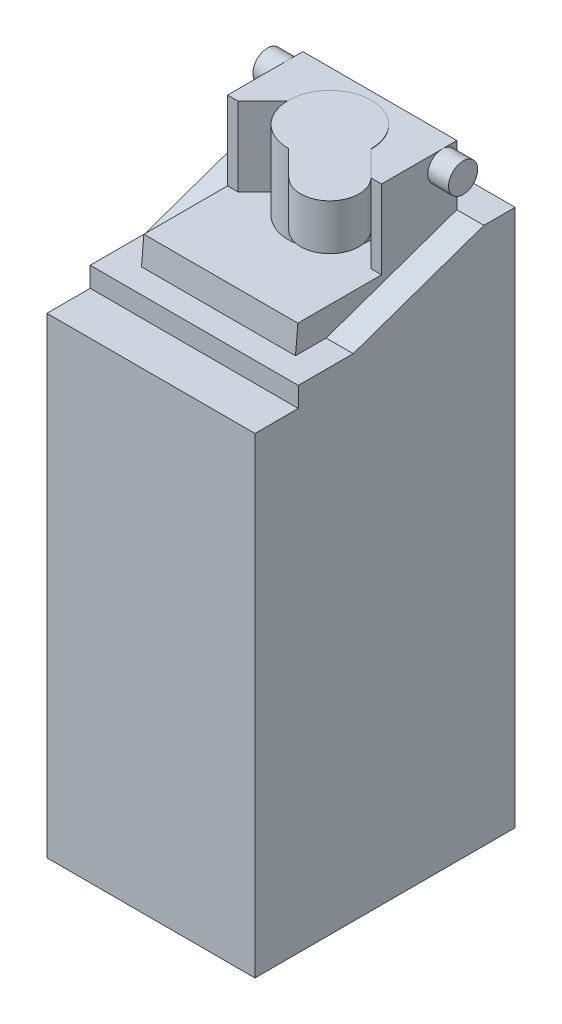
ISO-10303-21;
HEADER;
FILE_DESCRIPTION(('STEP AP214'),'2;1');
FILE_NAME('part.step','',(''),(''),'','','');
FILE_SCHEMA(('AUTOMOTIVE_DESIGN { 1 0 10303 214 1 1 1 1 }'));
ENDSEC;
DATA;
#1=APPLICATION_CONTEXT('core data for automotive mechanical design processes');
#2=APPLICATION_PROTOCOL_DEFINITION('international standard','automotive_design',2000,#1);
#3=PRODUCT_CONTEXT('',#1,'mechanical');
#4=PRODUCT('Part','Part','',(#3));
#5=PRODUCT_RELATED_PRODUCT_CATEGORY('part','',(#4));
#6=PRODUCT_DEFINITION_FORMATION('','',#4);
#7=PRODUCT_DEFINITION_CONTEXT('part definition',#1,'design');
#8=PRODUCT_DEFINITION('design','',#6,#7);
#9=PRODUCT_DEFINITION_SHAPE('','',#8);
#10=(LENGTH_UNIT() NAMED_UNIT(*) SI_UNIT(.MILLI.,.METRE.));
#11=(NAMED_UNIT(*) PLANE_ANGLE_UNIT() SI_UNIT($,.RADIAN.));
#12=(NAMED_UNIT(*) SI_UNIT($,.STERADIAN.) SOLID_ANGLE_UNIT());
#13=UNCERTAINTY_MEASURE_WITH_UNIT(LENGTH_MEASURE(1.E-05),#10,'distance_accuracy_value','');
#14=(GEOMETRIC_REPRESENTATION_CONTEXT(3) GLOBAL_UNCERTAINTY_ASSIGNED_CONTEXT((#13)) GLOBAL_UNIT_ASSIGNED_CONTEXT((#10,
#11,#12)) REPRESENTATION_CONTEXT('',''));
#15=CARTESIAN_POINT('',(0.,0.,0.));
#16=DIRECTION('',(0.,0.,1.));
#17=DIRECTION('',(1.,0.,0.));
#18=AXIS2_PLACEMENT_3D('',#15,#16,#17);
#19=CARTESIAN_POINT('',(3.7,28.7,-7.38));
#20=DIRECTION('',(0.,-1.,0.));
#21=DIRECTION('',(0.,0.,-1.));
#22=AXIS2_PLACEMENT_3D('',#19,#20,#21);
#23=PLANE('',#22);
#24=CARTESIAN_POINT('',(0.,28.7,-8.6));
#25=DIRECTION('',(0.,-1.,0.));
#26=DIRECTION('',(0.,0.,-1.));
#27=AXIS2_PLACEMENT_3D('',#24,#25,#26);
#28=CIRCLE('',#27,2.);
#29=CARTESIAN_POINT('',(1.99990098524558,28.7,-8.58009901475445));
#30=VERTEX_POINT('',#29);
#31=CARTESIAN_POINT('',(-1.99990098524558,28.7,-8.5800990147544));
#32=VERTEX_POINT('',#31);
#33=EDGE_CURVE('E40',#30,#32,#28,.F.);
#34=ORIENTED_EDGE('',*,*,#33,.F.);
#35=DIRECTION('',(-0.707106781186551,0.,-0.707106781186544));
#36=VECTOR('',#35,1.);
#37=CARTESIAN_POINT('',(0.,28.7,-10.58));
#38=LINE('',#37,#36);
#39=CARTESIAN_POINT('',(3.20000000000005,28.7,-7.38));
#40=VERTEX_POINT('',#39);
#41=EDGE_CURVE('E227',#40,#30,#38,.T.);
#42=ORIENTED_EDGE('',*,*,#41,.F.);
#43=DIRECTION('',(-1.,0.,0.));
#44=VECTOR('',#43,1.);
#45=CARTESIAN_POINT('',(3.7,28.7,-7.38));
#46=LINE('',#45,#44);
#47=CARTESIAN_POINT('',(3.7,28.7,-7.38));
#48=VERTEX_POINT('',#47);
#49=EDGE_CURVE('E328',#48,#40,#46,.T.);
#50=ORIENTED_EDGE('',*,*,#49,.F.);
#51=DIRECTION('',(0.,0.,1.));
#52=VECTOR('',#51,1.);
#53=CARTESIAN_POINT('',(3.7,28.7,-7.38));
#54=LINE('',#53,#52);
#55=CARTESIAN_POINT('',(3.7,28.7,-10.3));
#56=VERTEX_POINT('',#55);
#57=EDGE_CURVE('E323',#56,#48,#54,.T.);
#58=ORIENTED_EDGE('',*,*,#57,.F.);
#59=CARTESIAN_POINT('',(3.7,28.7,-11.));
#60=VERTEX_POINT('',#59);
#61=EDGE_CURVE('E324',#60,#56,#54,.T.);
#62=ORIENTED_EDGE('',*,*,#61,.F.);
#63=DIRECTION('',(-1.,0.,0.));
#64=VECTOR('',#63,1.);
#65=CARTESIAN_POINT('',(3.7,28.7,-11.));
#66=LINE('',#65,#64);
#67=CARTESIAN_POINT('',(-3.7,28.7,-11.));
#68=VERTEX_POINT('',#67);
#69=EDGE_CURVE('E331',#60,#68,#66,.T.);
#70=ORIENTED_EDGE('',*,*,#69,.T.);
#71=DIRECTION('',(0.,0.,1.));
#72=VECTOR('',#71,1.);
#73=CARTESIAN_POINT('',(-3.7,28.7,-7.38));
#74=LINE('',#73,#72);
#75=CARTESIAN_POINT('',(-3.7,28.7,-10.3));
#76=VERTEX_POINT('',#75);
#77=EDGE_CURVE('E260',#68,#76,#74,.T.);
#78=ORIENTED_EDGE('',*,*,#77,.T.);
#79=CARTESIAN_POINT('',(-3.7,28.7,-7.38));
#80=VERTEX_POINT('',#79);
#81=EDGE_CURVE('E259',#76,#80,#74,.T.);
#82=ORIENTED_EDGE('',*,*,#81,.T.);
#83=CARTESIAN_POINT('',(-3.19999999999995,28.7,-7.38));
#84=VERTEX_POINT('',#83);
#85=EDGE_CURVE('E327',#84,#80,#46,.T.);
#86=ORIENTED_EDGE('',*,*,#85,.F.);
#87=DIRECTION('',(-0.707106781186541,0.,0.707106781186554));
#88=VECTOR('',#87,1.);
#89=CARTESIAN_POINT('',(-3.19999999999995,28.7,-7.38));
#90=LINE('',#89,#88);
#91=EDGE_CURVE('E230',#32,#84,#90,.T.);
#92=ORIENTED_EDGE('',*,*,#91,.F.);
#93=EDGE_LOOP('',(#34,#42,#50,#58,#62,#70,#78,#82,#86,#92));
#94=FACE_BOUND('',#93,.T.);
#95=ADVANCED_FACE('F17',(#94),#23,.F.);
#96=CARTESIAN_POINT('',(3.7,24.92,-3.36));
#97=DIRECTION('',(0.,-1.,0.));
#98=DIRECTION('',(0.,0.,-1.));
#99=AXIS2_PLACEMENT_3D('',#96,#97,#98);
#100=PLANE('',#99);
#101=CARTESIAN_POINT('',(0.,24.92,-8.6));
#102=DIRECTION('',(0.,1.,0.));
#103=DIRECTION('',(0.,0.,1.));
#104=AXIS2_PLACEMENT_3D('',#101,#102,#103);
#105=CIRCLE('',#104,2.);
#106=CARTESIAN_POINT('',(-1.99990098524559,24.92,-8.5800990147544));
#107=VERTEX_POINT('',#106);
#108=CARTESIAN_POINT('',(1.99990098524558,24.92,-8.58009901475445));
#109=VERTEX_POINT('',#108);
#110=EDGE_CURVE('E215',#107,#109,#105,.T.);
#111=ORIENTED_EDGE('',*,*,#110,.F.);
#112=DIRECTION('',(-0.707106781186541,0.,0.707106781186554));
#113=VECTOR('',#112,1.);
#114=CARTESIAN_POINT('',(-3.19999999999996,24.92,-7.38));
#115=LINE('',#114,#113);
#116=CARTESIAN_POINT('',(-3.19999999999996,24.92,-7.38));
#117=VERTEX_POINT('',#116);
#118=EDGE_CURVE('E225',#107,#117,#115,.T.);
#119=ORIENTED_EDGE('',*,*,#118,.T.);
#120=DIRECTION('',(-1.,0.,0.));
#121=VECTOR('',#120,1.);
#122=CARTESIAN_POINT('',(3.7,24.92,-7.38));
#123=LINE('',#122,#121);
#124=CARTESIAN_POINT('',(-3.7,24.92,-7.38));
#125=VERTEX_POINT('',#124);
#126=EDGE_CURVE('E310',#117,#125,#123,.T.);
#127=ORIENTED_EDGE('',*,*,#126,.T.);
#128=DIRECTION('',(0.,0.,1.));
#129=VECTOR('',#128,1.);
#130=CARTESIAN_POINT('',(-3.7,24.92,-3.36));
#131=LINE('',#130,#129);
#132=CARTESIAN_POINT('',(-3.7,24.92,-3.36));
#133=VERTEX_POINT('',#132);
#134=EDGE_CURVE('E244',#125,#133,#131,.T.);
#135=ORIENTED_EDGE('',*,*,#134,.T.);
#136=DIRECTION('',(-1.,0.,0.));
#137=VECTOR('',#136,1.);
#138=CARTESIAN_POINT('',(3.7,24.92,-3.36));
#139=LINE('',#138,#137);
#140=CARTESIAN_POINT('',(3.7,24.92,-3.36));
#141=VERTEX_POINT('',#140);
#142=EDGE_CURVE('E308',#141,#133,#139,.T.);
#143=ORIENTED_EDGE('',*,*,#142,.F.);
#144=DIRECTION('',(0.,0.,1.));
#145=VECTOR('',#144,1.);
#146=CARTESIAN_POINT('',(3.7,24.92,-3.36));
#147=LINE('',#146,#145);
#148=CARTESIAN_POINT('',(3.7,24.92,-7.38));
#149=VERTEX_POINT('',#148);
#150=EDGE_CURVE('E303',#149,#141,#147,.T.);
#151=ORIENTED_EDGE('',*,*,#150,.F.);
#152=CARTESIAN_POINT('',(3.20000000000004,24.92,-7.38));
#153=VERTEX_POINT('',#152);
#154=EDGE_CURVE('E311',#149,#153,#123,.T.);
#155=ORIENTED_EDGE('',*,*,#154,.T.);
#156=DIRECTION('',(-0.707106781186551,0.,-0.707106781186544));
#157=VECTOR('',#156,1.);
#158=CARTESIAN_POINT('',(0.,24.92,-10.58));
#159=LINE('',#158,#157);
#160=EDGE_CURVE('E222',#153,#109,#159,.T.);
#161=ORIENTED_EDGE('',*,*,#160,.T.);
#162=EDGE_LOOP('',(#111,#119,#127,#135,#143,#151,#155,#161));
#163=FACE_BOUND('',#162,.T.);
#164=ADVANCED_FACE('F393',(#163),#100,.F.);
#165=CARTESIAN_POINT('',(0.,28.7,-10.58));
#166=DIRECTION('',(-0.707106781186544,0.,0.707106781186551));
#167=DIRECTION('',(0.707106781186551,0.,0.707106781186544));
#168=AXIS2_PLACEMENT_3D('',#165,#166,#167);
#169=PLANE('',#168);
#170=ORIENTED_EDGE('',*,*,#41,.T.);
#171=DIRECTION('',(0.,-1.,0.));
#172=VECTOR('',#171,1.);
#173=CARTESIAN_POINT('',(1.99990098524558,28.72,-8.58009901475445));
#174=LINE('',#173,#172);
#175=EDGE_CURVE('E219',#30,#109,#174,.T.);
#176=ORIENTED_EDGE('',*,*,#175,.T.);
#177=ORIENTED_EDGE('',*,*,#160,.F.);
#178=DIRECTION('',(0.,-1.,0.));
#179=VECTOR('',#178,1.);
#180=CARTESIAN_POINT('',(3.20000000000005,28.7,-7.38));
#181=LINE('',#180,#179);
#182=EDGE_CURVE('E235',#40,#153,#181,.T.);
#183=ORIENTED_EDGE('',*,*,#182,.F.);
#184=EDGE_LOOP('',(#170,#176,#177,#183));
#185=FACE_BOUND('',#184,.T.);
#186=ADVANCED_FACE('F398',(#185),#169,.T.);
#187=CARTESIAN_POINT('',(-3.19999999999995,28.7,-7.38));
#188=DIRECTION('',(0.707106781186554,0.,0.707106781186541));
#189=DIRECTION('',(0.707106781186541,0.,-0.707106781186554));
#190=AXIS2_PLACEMENT_3D('',#187,#188,#189);
#191=PLANE('',#190);
#192=ORIENTED_EDGE('',*,*,#118,.F.);
#193=DIRECTION('',(0.,-1.,0.));
#194=VECTOR('',#193,1.);
#195=CARTESIAN_POINT('',(-1.99990098524558,28.72,-8.5800990147544));
#196=LINE('',#195,#194);
#197=EDGE_CURVE('E25',#107,#32,#196,.F.);
#198=ORIENTED_EDGE('',*,*,#197,.T.);
#199=ORIENTED_EDGE('',*,*,#91,.T.);
#200=DIRECTION('',(0.,-1.,0.));
#201=VECTOR('',#200,1.);
#202=CARTESIAN_POINT('',(-3.19999999999995,28.7,-7.38));
#203=LINE('',#202,#201);
#204=EDGE_CURVE('E232',#84,#117,#203,.T.);
#205=ORIENTED_EDGE('',*,*,#204,.T.);
#206=EDGE_LOOP('',(#192,#198,#199,#205));
#207=FACE_BOUND('',#206,.T.);
#208=ADVANCED_FACE('F380',(#207),#191,.T.);
#209=CARTESIAN_POINT('',(3.7,21.2,-7.38));
#210=DIRECTION('',(0.,0.,-1.));
#211=DIRECTION('',(-1.,0.,0.));
#212=AXIS2_PLACEMENT_3D('',#209,#210,#211);
#213=PLANE('',#212);
#214=ORIENTED_EDGE('',*,*,#182,.T.);
#215=ORIENTED_EDGE('',*,*,#154,.F.);
#216=DIRECTION('',(0.,-1.,0.));
#217=VECTOR('',#216,1.);
#218=CARTESIAN_POINT('',(3.7,21.2,-7.38));
#219=LINE('',#218,#217);
#220=EDGE_CURVE('E317',#48,#149,#219,.T.);
#221=ORIENTED_EDGE('',*,*,#220,.F.);
#222=ORIENTED_EDGE('',*,*,#49,.T.);
#223=EDGE_LOOP('',(#214,#215,#221,#222));
#224=FACE_BOUND('',#223,.T.);
#225=ADVANCED_FACE('F403',(#224),#213,.F.);
#226=ORIENTED_EDGE('',*,*,#204,.F.);
#227=ORIENTED_EDGE('',*,*,#85,.T.);
#228=DIRECTION('',(0.,-1.,0.));
#229=VECTOR('',#228,1.);
#230=CARTESIAN_POINT('',(-3.7,21.2,-7.38));
#231=LINE('',#230,#229);
#232=EDGE_CURVE('E253',#80,#125,#231,.T.);
#233=ORIENTED_EDGE('',*,*,#232,.T.);
#234=ORIENTED_EDGE('',*,*,#126,.F.);
#235=EDGE_LOOP('',(#226,#227,#233,#234));
#236=FACE_BOUND('',#235,.T.);
#237=ADVANCED_FACE('F389',(#236),#213,.F.);
#238=CARTESIAN_POINT('',(3.7,28.7,-7.38));
#239=DIRECTION('',(-1.,0.,0.));
#240=DIRECTION('',(0.,0.,1.));
#241=AXIS2_PLACEMENT_3D('',#238,#239,#240);
#242=PLANE('',#241);
#243=CARTESIAN_POINT('',(3.7,28.,-10.3));
#244=DIRECTION('',(1.,0.,0.));
#245=DIRECTION('',(0.,0.,-1.));
#246=AXIS2_PLACEMENT_3D('',#243,#244,#245);
#247=CIRCLE('',#246,0.699999999999999);
#248=CARTESIAN_POINT('',(3.7,28.,-11.));
#249=VERTEX_POINT('',#248);
#250=EDGE_CURVE('E297',#249,#56,#247,.T.);
#251=ORIENTED_EDGE('',*,*,#250,.F.);
#252=DIRECTION('',(0.,1.,0.));
#253=VECTOR('',#252,1.);
#254=CARTESIAN_POINT('',(3.7,21.2,-11.));
#255=LINE('',#254,#253);
#256=EDGE_CURVE('E320',#249,#60,#255,.T.);
#257=ORIENTED_EDGE('',*,*,#256,.T.);
#258=ORIENTED_EDGE('',*,*,#61,.T.);
#259=EDGE_LOOP('',(#251,#257,#258));
#260=FACE_BOUND('',#259,.T.);
#261=ADVANCED_FACE('F440',(#260),#242,.F.);
#262=CARTESIAN_POINT('',(3.7,28.,-10.3));
#263=DIRECTION('',(-1.,0.,0.));
#264=DIRECTION('',(0.,0.,1.));
#265=AXIS2_PLACEMENT_3D('',#262,#263,#264);
#266=CIRCLE('',#265,0.699999999999999);
#267=EDGE_CURVE('E375',#56,#249,#266,.F.);
#268=ORIENTED_EDGE('',*,*,#267,.F.);
#269=ORIENTED_EDGE('',*,*,#57,.T.);
#270=ORIENTED_EDGE('',*,*,#220,.T.);
#271=ORIENTED_EDGE('',*,*,#150,.T.);
#272=DIRECTION('',(0.,-0.996194698091746,0.0871557427476543));
#273=VECTOR('',#272,1.);
#274=CARTESIAN_POINT('',(3.7,21.92,-3.09753400942224));
#275=LINE('',#274,#273);
#276=CARTESIAN_POINT('',(3.7,23.62,-3.2462647374163));
#277=VERTEX_POINT('',#276);
#278=EDGE_CURVE('E305',#141,#277,#275,.T.);
#279=ORIENTED_EDGE('',*,*,#278,.T.);
#280=DIRECTION('',(0.,0.,-1.));
#281=VECTOR('',#280,1.);
#282=CARTESIAN_POINT('',(3.7,23.62,-2.08));
#283=LINE('',#282,#281);
#284=CARTESIAN_POINT('',(3.7,23.62,-4.72));
#285=VERTEX_POINT('',#284);
#286=EDGE_CURVE('E314',#277,#285,#283,.T.);
#287=ORIENTED_EDGE('',*,*,#286,.T.);
#288=DIRECTION('',(0.,-0.33061817266007,0.943764601956927));
#289=VECTOR('',#288,1.);
#290=CARTESIAN_POINT('',(3.7,23.62,-4.72));
#291=LINE('',#290,#289);
#292=CARTESIAN_POINT('',(3.7,25.82,-11.));
#293=VERTEX_POINT('',#292);
#294=EDGE_CURVE('E371',#293,#285,#291,.T.);
#295=ORIENTED_EDGE('',*,*,#294,.F.);
#296=EDGE_CURVE('E321',#293,#249,#255,.T.);
#297=ORIENTED_EDGE('',*,*,#296,.T.);
#298=EDGE_LOOP('',(#268,#269,#270,#271,#279,#287,#295,#297));
#299=FACE_BOUND('',#298,.T.);
#300=ADVANCED_FACE('F406',(#299),#242,.F.);
#301=CARTESIAN_POINT('',(5.,23.62,-2.08));
#302=DIRECTION('',(0.,1.,0.));
#303=DIRECTION('',(0.,0.,1.));
#304=AXIS2_PLACEMENT_3D('',#301,#302,#303);
#305=PLANE('',#304);
#306=ORIENTED_EDGE('',*,*,#286,.F.);
#307=DIRECTION('',(-1.,0.,0.));
#308=VECTOR('',#307,1.);
#309=CARTESIAN_POINT('',(5.,23.62,-3.2462647374163));
#310=LINE('',#309,#308);
#311=CARTESIAN_POINT('',(-3.7,23.62,-3.2462647374163));
#312=VERTEX_POINT('',#311);
#313=EDGE_CURVE('E373',#277,#312,#310,.T.);
#314=ORIENTED_EDGE('',*,*,#313,.T.);
#315=DIRECTION('',(0.,0.,-1.));
#316=VECTOR('',#315,1.);
#317=CARTESIAN_POINT('',(-3.7,23.62,-2.08));
#318=LINE('',#317,#316);
#319=CARTESIAN_POINT('',(-3.7,23.62,-4.72));
#320=VERTEX_POINT('',#319);
#321=EDGE_CURVE('E250',#312,#320,#318,.T.);
#322=ORIENTED_EDGE('',*,*,#321,.T.);
#323=DIRECTION('',(1.,0.,0.));
#324=VECTOR('',#323,1.);
#325=CARTESIAN_POINT('',(-5.,23.62,-4.72));
#326=LINE('',#325,#324);
#327=CARTESIAN_POINT('',(-5.,23.62,-4.72));
#328=VERTEX_POINT('',#327);
#329=EDGE_CURVE('E272',#328,#320,#326,.T.);
#330=ORIENTED_EDGE('',*,*,#329,.F.);
#331=DIRECTION('',(0.,0.,-1.));
#332=VECTOR('',#331,1.);
#333=CARTESIAN_POINT('',(-5.,23.62,-2.08));
#334=LINE('',#333,#332);
#335=CARTESIAN_POINT('',(-5.,23.62,-2.08));
#336=VERTEX_POINT('',#335);
#337=EDGE_CURVE('E269',#336,#328,#334,.T.);
#338=ORIENTED_EDGE('',*,*,#337,.F.);
#339=DIRECTION('',(-1.,0.,0.));
#340=VECTOR('',#339,1.);
#341=CARTESIAN_POINT('',(5.,23.62,-2.08));
#342=LINE('',#341,#340);
#343=CARTESIAN_POINT('',(5.,23.62,-2.08));
#344=VERTEX_POINT('',#343);
#345=EDGE_CURVE('E345',#344,#336,#342,.T.);
#346=ORIENTED_EDGE('',*,*,#345,.F.);
#347=DIRECTION('',(0.,0.,-1.));
#348=VECTOR('',#347,1.);
#349=CARTESIAN_POINT('',(5.,23.62,-2.08));
#350=LINE('',#349,#348);
#351=CARTESIAN_POINT('',(5.,23.62,-4.72));
#352=VERTEX_POINT('',#351);
#353=EDGE_CURVE('E339',#344,#352,#350,.T.);
#354=ORIENTED_EDGE('',*,*,#353,.T.);
#355=DIRECTION('',(-1.,0.,0.));
#356=VECTOR('',#355,1.);
#357=CARTESIAN_POINT('',(5.,23.62,-4.72));
#358=LINE('',#357,#356);
#359=EDGE_CURVE('E342',#352,#285,#358,.T.);
#360=ORIENTED_EDGE('',*,*,#359,.T.);
#361=EDGE_LOOP('',(#306,#314,#322,#330,#338,#346,#354,#360));
#362=FACE_BOUND('',#361,.T.);
#363=ADVANCED_FACE('F413',(#362),#305,.T.);
#364=CARTESIAN_POINT('',(5.,23.62,-4.72));
#365=DIRECTION('',(0.,0.943764601956927,0.33061817266007));
#366=DIRECTION('',(0.,-0.33061817266007,0.943764601956927));
#367=AXIS2_PLACEMENT_3D('',#364,#365,#366);
#368=PLANE('',#367);
#369=ORIENTED_EDGE('',*,*,#294,.T.);
#370=ORIENTED_EDGE('',*,*,#359,.F.);
#371=DIRECTION('',(0.,0.33061817266007,-0.943764601956927));
#372=VECTOR('',#371,1.);
#373=CARTESIAN_POINT('',(5.,23.62,-4.72));
#374=LINE('',#373,#372);
#375=CARTESIAN_POINT('',(5.,25.82,-11.));
#376=VERTEX_POINT('',#375);
#377=EDGE_CURVE('E333',#352,#376,#374,.T.);
#378=ORIENTED_EDGE('',*,*,#377,.T.);
#379=DIRECTION('',(-1.,0.,0.));
#380=VECTOR('',#379,1.);
#381=CARTESIAN_POINT('',(5.,25.82,-11.));
#382=LINE('',#381,#380);
#383=EDGE_CURVE('E336',#376,#293,#382,.T.);
#384=ORIENTED_EDGE('',*,*,#383,.T.);
#385=EDGE_LOOP('',(#369,#370,#378,#384));
#386=FACE_BOUND('',#385,.T.);
#387=ADVANCED_FACE('F417',(#386),#368,.T.);
#388=CARTESIAN_POINT('',(5.,25.82,0.));
#389=DIRECTION('',(0.,-1.,0.));
#390=DIRECTION('',(0.,0.,-1.));
#391=AXIS2_PLACEMENT_3D('',#388,#389,#390);
#392=PLANE('',#391);
#393=ORIENTED_EDGE('',*,*,#383,.F.);
#394=DIRECTION('',(0.,0.,1.));
#395=VECTOR('',#394,1.);
#396=CARTESIAN_POINT('',(5.,25.82,0.));
#397=LINE('',#396,#395);
#398=CARTESIAN_POINT('',(5.,25.82,-12.5));
#399=VERTEX_POINT('',#398);
#400=EDGE_CURVE('E362',#399,#376,#397,.T.);
#401=ORIENTED_EDGE('',*,*,#400,.F.);
#402=DIRECTION('',(-1.,0.,0.));
#403=VECTOR('',#402,1.);
#404=CARTESIAN_POINT('',(5.,25.82,-12.5));
#405=LINE('',#404,#403);
#406=CARTESIAN_POINT('',(-5.,25.82,-12.5));
#407=VERTEX_POINT('',#406);
#408=EDGE_CURVE('E365',#399,#407,#405,.T.);
#409=ORIENTED_EDGE('',*,*,#408,.T.);
#410=DIRECTION('',(0.,0.,1.));
#411=VECTOR('',#410,1.);
#412=CARTESIAN_POINT('',(-5.,25.82,0.));
#413=LINE('',#412,#411);
#414=CARTESIAN_POINT('',(-5.,25.82,-11.));
#415=VERTEX_POINT('',#414);
#416=EDGE_CURVE('E289',#407,#415,#413,.T.);
#417=ORIENTED_EDGE('',*,*,#416,.T.);
#418=DIRECTION('',(1.,0.,0.));
#419=VECTOR('',#418,1.);
#420=CARTESIAN_POINT('',(-5.,25.82,-11.));
#421=LINE('',#420,#419);
#422=CARTESIAN_POINT('',(-3.7,25.82,-11.));
#423=VERTEX_POINT('',#422);
#424=EDGE_CURVE('E266',#415,#423,#421,.T.);
#425=ORIENTED_EDGE('',*,*,#424,.T.);
#426=EDGE_CURVE('E335',#293,#423,#382,.T.);
#427=ORIENTED_EDGE('',*,*,#426,.F.);
#428=EDGE_LOOP('',(#393,#401,#409,#417,#425,#427));
#429=FACE_BOUND('',#428,.T.);
#430=ADVANCED_FACE('F426',(#429),#392,.F.);
#431=CARTESIAN_POINT('',(5.,25.82,0.));
#432=DIRECTION('',(-1.,0.,0.));
#433=DIRECTION('',(0.,0.,1.));
#434=AXIS2_PLACEMENT_3D('',#431,#432,#433);
#435=PLANE('',#434);
#436=ORIENTED_EDGE('',*,*,#377,.F.);
#437=ORIENTED_EDGE('',*,*,#353,.F.);
#438=DIRECTION('',(0.,1.,0.));
#439=VECTOR('',#438,1.);
#440=CARTESIAN_POINT('',(5.,22.66,-2.08));
#441=LINE('',#440,#439);
#442=CARTESIAN_POINT('',(5.,22.66,-2.08));
#443=VERTEX_POINT('',#442);
#444=EDGE_CURVE('E349',#443,#344,#441,.T.);
#445=ORIENTED_EDGE('',*,*,#444,.F.);
#446=DIRECTION('',(0.,0.,-1.));
#447=VECTOR('',#446,1.);
#448=CARTESIAN_POINT('',(5.,22.66,0.));
#449=LINE('',#448,#447);
#450=CARTESIAN_POINT('',(5.,22.66,0.));
#451=VERTEX_POINT('',#450);
#452=EDGE_CURVE('E347',#451,#443,#449,.T.);
#453=ORIENTED_EDGE('',*,*,#452,.F.);
#454=DIRECTION('',(0.,-1.,0.));
#455=VECTOR('',#454,1.);
#456=CARTESIAN_POINT('',(5.,0.,0.));
#457=LINE('',#456,#455);
#458=CARTESIAN_POINT('',(5.,0.,0.));
#459=VERTEX_POINT('',#458);
#460=EDGE_CURVE('E356',#451,#459,#457,.T.);
#461=ORIENTED_EDGE('',*,*,#460,.T.);
#462=DIRECTION('',(0.,0.,-1.));
#463=VECTOR('',#462,1.);
#464=CARTESIAN_POINT('',(5.,0.,0.));
#465=LINE('',#464,#463);
#466=CARTESIAN_POINT('',(5.,0.,-12.5));
#467=VERTEX_POINT('',#466);
#468=EDGE_CURVE('E358',#459,#467,#465,.T.);
#469=ORIENTED_EDGE('',*,*,#468,.T.);
#470=DIRECTION('',(0.,1.,0.));
#471=VECTOR('',#470,1.);
#472=CARTESIAN_POINT('',(5.,0.,-12.5));
#473=LINE('',#472,#471);
#474=EDGE_CURVE('E360',#467,#399,#473,.T.);
#475=ORIENTED_EDGE('',*,*,#474,.T.);
#476=ORIENTED_EDGE('',*,*,#400,.T.);
#477=EDGE_LOOP('',(#436,#437,#445,#453,#461,#469,#475,#476));
#478=FACE_BOUND('',#477,.T.);
#479=ADVANCED_FACE('F420',(#478),#435,.F.);
#480=CARTESIAN_POINT('',(5.,22.66,-2.08));
#481=DIRECTION('',(0.,0.,1.));
#482=DIRECTION('',(1.,0.,0.));
#483=AXIS2_PLACEMENT_3D('',#480,#481,#482);
#484=PLANE('',#483);
#485=ORIENTED_EDGE('',*,*,#444,.T.);
#486=ORIENTED_EDGE('',*,*,#345,.T.);
#487=DIRECTION('',(0.,1.,0.));
#488=VECTOR('',#487,1.);
#489=CARTESIAN_POINT('',(-5.,22.66,-2.08));
#490=LINE('',#489,#488);
#491=CARTESIAN_POINT('',(-5.,22.66,-2.08));
#492=VERTEX_POINT('',#491);
#493=EDGE_CURVE('E277',#492,#336,#490,.T.);
#494=ORIENTED_EDGE('',*,*,#493,.F.);
#495=DIRECTION('',(-1.,0.,0.));
#496=VECTOR('',#495,1.);
#497=CARTESIAN_POINT('',(5.,22.66,-2.08));
#498=LINE('',#497,#496);
#499=EDGE_CURVE('E352',#443,#492,#498,.T.);
#500=ORIENTED_EDGE('',*,*,#499,.F.);
#501=EDGE_LOOP('',(#485,#486,#494,#500));
#502=FACE_BOUND('',#501,.T.);
#503=ADVANCED_FACE('F473',(#502),#484,.T.);
#504=CARTESIAN_POINT('',(5.,0.,0.));
#505=DIRECTION('',(0.,0.,-1.));
#506=DIRECTION('',(-1.,0.,0.));
#507=AXIS2_PLACEMENT_3D('',#504,#505,#506);
#508=PLANE('',#507);
#509=DIRECTION('',(-1.,0.,0.));
#510=VECTOR('',#509,1.);
#511=CARTESIAN_POINT('',(5.,22.66,0.));
#512=LINE('',#511,#510);
#513=CARTESIAN_POINT('',(-5.,22.66,0.));
#514=VERTEX_POINT('',#513);
#515=EDGE_CURVE('E354',#451,#514,#512,.T.);
#516=ORIENTED_EDGE('',*,*,#515,.T.);
#517=DIRECTION('',(0.,-1.,0.));
#518=VECTOR('',#517,1.);
#519=CARTESIAN_POINT('',(-5.,0.,0.));
#520=LINE('',#519,#518);
#521=CARTESIAN_POINT('',(-5.,0.,0.));
#522=VERTEX_POINT('',#521);
#523=EDGE_CURVE('E280',#514,#522,#520,.T.);
#524=ORIENTED_EDGE('',*,*,#523,.T.);
#525=DIRECTION('',(-1.,0.,0.));
#526=VECTOR('',#525,1.);
#527=CARTESIAN_POINT('',(5.,0.,0.));
#528=LINE('',#527,#526);
#529=EDGE_CURVE('E369',#459,#522,#528,.T.);
#530=ORIENTED_EDGE('',*,*,#529,.F.);
#531=ORIENTED_EDGE('',*,*,#460,.F.);
#532=EDGE_LOOP('',(#516,#524,#530,#531));
#533=FACE_BOUND('',#532,.T.);
#534=ADVANCED_FACE('F19',(#533),#508,.F.);
#535=CARTESIAN_POINT('',(5.,0.,0.));
#536=DIRECTION('',(0.,1.,0.));
#537=DIRECTION('',(0.,0.,1.));
#538=AXIS2_PLACEMENT_3D('',#535,#536,#537);
#539=PLANE('',#538);
#540=ORIENTED_EDGE('',*,*,#529,.T.);
#541=DIRECTION('',(0.,0.,-1.));
#542=VECTOR('',#541,1.);
#543=CARTESIAN_POINT('',(-5.,0.,0.));
#544=LINE('',#543,#542);
#545=CARTESIAN_POINT('',(-5.,0.,-12.5));
#546=VERTEX_POINT('',#545);
#547=EDGE_CURVE('E283',#522,#546,#544,.T.);
#548=ORIENTED_EDGE('',*,*,#547,.T.);
#549=DIRECTION('',(-1.,0.,0.));
#550=VECTOR('',#549,1.);
#551=CARTESIAN_POINT('',(5.,0.,-12.5));
#552=LINE('',#551,#550);
#553=EDGE_CURVE('E367',#467,#546,#552,.T.);
#554=ORIENTED_EDGE('',*,*,#553,.F.);
#555=ORIENTED_EDGE('',*,*,#468,.F.);
#556=EDGE_LOOP('',(#540,#548,#554,#555));
#557=FACE_BOUND('',#556,.T.);
#558=ADVANCED_FACE('F486',(#557),#539,.F.);
#559=CARTESIAN_POINT('',(5.,0.,-12.5));
#560=DIRECTION('',(0.,0.,1.));
#561=DIRECTION('',(1.,0.,0.));
#562=AXIS2_PLACEMENT_3D('',#559,#560,#561);
#563=PLANE('',#562);
#564=ORIENTED_EDGE('',*,*,#553,.T.);
#565=DIRECTION('',(0.,1.,0.));
#566=VECTOR('',#565,1.);
#567=CARTESIAN_POINT('',(-5.,0.,-12.5));
#568=LINE('',#567,#566);
#569=EDGE_CURVE('E286',#546,#407,#568,.T.);
#570=ORIENTED_EDGE('',*,*,#569,.T.);
#571=ORIENTED_EDGE('',*,*,#408,.F.);
#572=ORIENTED_EDGE('',*,*,#474,.F.);
#573=EDGE_LOOP('',(#564,#570,#571,#572));
#574=FACE_BOUND('',#573,.T.);
#575=ADVANCED_FACE('F479',(#574),#563,.F.);
#576=CARTESIAN_POINT('',(5.,22.66,0.));
#577=DIRECTION('',(0.,1.,0.));
#578=DIRECTION('',(0.,0.,1.));
#579=AXIS2_PLACEMENT_3D('',#576,#577,#578);
#580=PLANE('',#579);
#581=ORIENTED_EDGE('',*,*,#499,.T.);
#582=DIRECTION('',(0.,0.,-1.));
#583=VECTOR('',#582,1.);
#584=CARTESIAN_POINT('',(-5.,22.66,0.));
#585=LINE('',#584,#583);
#586=EDGE_CURVE('E274',#514,#492,#585,.T.);
#587=ORIENTED_EDGE('',*,*,#586,.F.);
#588=ORIENTED_EDGE('',*,*,#515,.F.);
#589=ORIENTED_EDGE('',*,*,#452,.T.);
#590=EDGE_LOOP('',(#581,#587,#588,#589));
#591=FACE_BOUND('',#590,.T.);
#592=ADVANCED_FACE('F466',(#591),#580,.T.);
#593=CARTESIAN_POINT('',(3.7,21.2,-11.));
#594=DIRECTION('',(0.,0.,1.));
#595=DIRECTION('',(1.,0.,0.));
#596=AXIS2_PLACEMENT_3D('',#593,#594,#595);
#597=PLANE('',#596);
#598=ORIENTED_EDGE('',*,*,#426,.T.);
#599=DIRECTION('',(0.,1.,0.));
#600=VECTOR('',#599,1.);
#601=CARTESIAN_POINT('',(-3.7,21.2,-11.));
#602=LINE('',#601,#600);
#603=CARTESIAN_POINT('',(-3.7,28.,-11.));
#604=VERTEX_POINT('',#603);
#605=EDGE_CURVE('E257',#423,#604,#602,.T.);
#606=ORIENTED_EDGE('',*,*,#605,.T.);
#607=EDGE_CURVE('E256',#604,#68,#602,.T.);
#608=ORIENTED_EDGE('',*,*,#607,.T.);
#609=ORIENTED_EDGE('',*,*,#69,.F.);
#610=ORIENTED_EDGE('',*,*,#256,.F.);
#611=ORIENTED_EDGE('',*,*,#296,.F.);
#612=EDGE_LOOP('',(#598,#606,#608,#609,#610,#611));
#613=FACE_BOUND('',#612,.T.);
#614=ADVANCED_FACE('F431',(#613),#597,.F.);
#615=CARTESIAN_POINT('',(3.7,21.92,-3.09753400942224));
#616=DIRECTION('',(0.,-0.0871557427476543,-0.996194698091746));
#617=DIRECTION('',(0.,0.996194698091746,-0.0871557427476544));
#618=AXIS2_PLACEMENT_3D('',#615,#616,#617);
#619=PLANE('',#618);
#620=ORIENTED_EDGE('',*,*,#313,.F.);
#621=ORIENTED_EDGE('',*,*,#278,.F.);
#622=ORIENTED_EDGE('',*,*,#142,.T.);
#623=DIRECTION('',(0.,-0.996194698091746,0.0871557427476543));
#624=VECTOR('',#623,1.);
#625=CARTESIAN_POINT('',(-3.7,21.92,-3.09753400942224));
#626=LINE('',#625,#624);
#627=EDGE_CURVE('E247',#133,#312,#626,.T.);
#628=ORIENTED_EDGE('',*,*,#627,.T.);
#629=EDGE_LOOP('',(#620,#621,#622,#628));
#630=FACE_BOUND('',#629,.T.);
#631=ADVANCED_FACE('F410',(#630),#619,.F.);
#632=CARTESIAN_POINT('',(4.69999999999999,28.,-10.3));
#633=DIRECTION('',(-1.,0.,0.));
#634=DIRECTION('',(0.,0.,1.));
#635=AXIS2_PLACEMENT_3D('',#632,#633,#634);
#636=CYLINDRICAL_SURFACE('',#635,0.699999999999999);
#637=CARTESIAN_POINT('',(4.69999999999999,28.,-10.3));
#638=DIRECTION('',(1.,0.,0.));
#639=DIRECTION('',(0.,0.,-1.));
#640=AXIS2_PLACEMENT_3D('',#637,#638,#639);
#641=CIRCLE('',#640,0.699999999999999);
#642=CARTESIAN_POINT('',(4.69999999999999,28.,-11.));
#643=VERTEX_POINT('',#642);
#644=EDGE_CURVE('E300',#643,#643,#641,.T.);
#645=ORIENTED_EDGE('',*,*,#644,.F.);
#646=EDGE_LOOP('',(#645));
#647=FACE_BOUND('',#646,.T.);
#648=ORIENTED_EDGE('',*,*,#250,.T.);
#649=ORIENTED_EDGE('',*,*,#267,.T.);
#650=EDGE_LOOP('',(#648,#649));
#651=FACE_BOUND('',#650,.T.);
#652=ADVANCED_FACE('F441',(#647,#651),#636,.T.);
#653=CARTESIAN_POINT('',(4.69999999999999,28.,-10.3));
#654=DIRECTION('',(1.,0.,0.));
#655=DIRECTION('',(0.,0.,-1.));
#656=AXIS2_PLACEMENT_3D('',#653,#654,#655);
#657=PLANE('',#656);
#658=ORIENTED_EDGE('',*,*,#644,.T.);
#659=EDGE_LOOP('',(#658));
#660=FACE_BOUND('',#659,.T.);
#661=ADVANCED_FACE('F443',(#660),#657,.T.);
#662=CARTESIAN_POINT('',(-3.7,28.7,-7.38));
#663=DIRECTION('',(1.,0.,0.));
#664=DIRECTION('',(0.,0.,1.));
#665=AXIS2_PLACEMENT_3D('',#662,#663,#664);
#666=PLANE('',#665);
#667=CARTESIAN_POINT('',(-3.7,28.,-10.3));
#668=DIRECTION('',(1.,0.,0.));
#669=DIRECTION('',(0.,0.,-1.));
#670=AXIS2_PLACEMENT_3D('',#667,#668,#669);
#671=CIRCLE('',#670,0.699999999999999);
#672=EDGE_CURVE('E238',#604,#76,#671,.T.);
#673=ORIENTED_EDGE('',*,*,#672,.T.);
#674=ORIENTED_EDGE('',*,*,#77,.F.);
#675=ORIENTED_EDGE('',*,*,#607,.F.);
#676=EDGE_LOOP('',(#673,#674,#675));
#677=FACE_BOUND('',#676,.T.);
#678=ADVANCED_FACE('F451',(#677),#666,.F.);
#679=CARTESIAN_POINT('',(-3.7,28.,-10.3));
#680=DIRECTION('',(-1.,0.,0.));
#681=DIRECTION('',(0.,0.,1.));
#682=AXIS2_PLACEMENT_3D('',#679,#680,#681);
#683=CIRCLE('',#682,0.699999999999999);
#684=EDGE_CURVE('E294',#76,#604,#683,.F.);
#685=ORIENTED_EDGE('',*,*,#684,.T.);
#686=ORIENTED_EDGE('',*,*,#605,.F.);
#687=DIRECTION('',(0.,-0.33061817266007,0.943764601956927));
#688=VECTOR('',#687,1.);
#689=CARTESIAN_POINT('',(-3.7,23.62,-4.72));
#690=LINE('',#689,#688);
#691=EDGE_CURVE('E291',#423,#320,#690,.T.);
#692=ORIENTED_EDGE('',*,*,#691,.T.);
#693=ORIENTED_EDGE('',*,*,#321,.F.);
#694=ORIENTED_EDGE('',*,*,#627,.F.);
#695=ORIENTED_EDGE('',*,*,#134,.F.);
#696=ORIENTED_EDGE('',*,*,#232,.F.);
#697=ORIENTED_EDGE('',*,*,#81,.F.);
#698=EDGE_LOOP('',(#685,#686,#692,#693,#694,#695,#696,#697));
#699=FACE_BOUND('',#698,.T.);
#700=ADVANCED_FACE('F511',(#699),#666,.F.);
#701=CARTESIAN_POINT('',(-5.,23.62,-4.72));
#702=DIRECTION('',(0.,0.943764601956927,0.33061817266007));
#703=DIRECTION('',(0.,-0.33061817266007,0.943764601956927));
#704=AXIS2_PLACEMENT_3D('',#701,#702,#703);
#705=PLANE('',#704);
#706=ORIENTED_EDGE('',*,*,#691,.F.);
#707=ORIENTED_EDGE('',*,*,#424,.F.);
#708=DIRECTION('',(0.,0.33061817266007,-0.943764601956927));
#709=VECTOR('',#708,1.);
#710=CARTESIAN_POINT('',(-5.,23.62,-4.72));
#711=LINE('',#710,#709);
#712=EDGE_CURVE('E263',#328,#415,#711,.T.);
#713=ORIENTED_EDGE('',*,*,#712,.F.);
#714=ORIENTED_EDGE('',*,*,#329,.T.);
#715=EDGE_LOOP('',(#706,#707,#713,#714));
#716=FACE_BOUND('',#715,.T.);
#717=ADVANCED_FACE('F508',(#716),#705,.T.);
#718=CARTESIAN_POINT('',(-5.,25.82,0.));
#719=DIRECTION('',(1.,0.,0.));
#720=DIRECTION('',(0.,0.,1.));
#721=AXIS2_PLACEMENT_3D('',#718,#719,#720);
#722=PLANE('',#721);
#723=ORIENTED_EDGE('',*,*,#712,.T.);
#724=ORIENTED_EDGE('',*,*,#416,.F.);
#725=ORIENTED_EDGE('',*,*,#569,.F.);
#726=ORIENTED_EDGE('',*,*,#547,.F.);
#727=ORIENTED_EDGE('',*,*,#523,.F.);
#728=ORIENTED_EDGE('',*,*,#586,.T.);
#729=ORIENTED_EDGE('',*,*,#493,.T.);
#730=ORIENTED_EDGE('',*,*,#337,.T.);
#731=EDGE_LOOP('',(#723,#724,#725,#726,#727,#728,#729,#730));
#732=FACE_BOUND('',#731,.T.);
#733=ADVANCED_FACE('F503',(#732),#722,.F.);
#734=CARTESIAN_POINT('',(-4.70000000000001,28.,-10.3));
#735=DIRECTION('',(1.,0.,0.));
#736=DIRECTION('',(0.,0.,1.));
#737=AXIS2_PLACEMENT_3D('',#734,#735,#736);
#738=CYLINDRICAL_SURFACE('',#737,0.699999999999999);
#739=CARTESIAN_POINT('',(-4.70000000000001,28.,-10.3));
#740=DIRECTION('',(1.,0.,0.));
#741=DIRECTION('',(0.,0.,-1.));
#742=AXIS2_PLACEMENT_3D('',#739,#740,#741);
#743=CIRCLE('',#742,0.699999999999999);
#744=CARTESIAN_POINT('',(-4.70000000000001,28.,-11.));
#745=VERTEX_POINT('',#744);
#746=EDGE_CURVE('E241',#745,#745,#743,.T.);
#747=ORIENTED_EDGE('',*,*,#746,.T.);
#748=EDGE_LOOP('',(#747));
#749=FACE_BOUND('',#748,.T.);
#750=ORIENTED_EDGE('',*,*,#672,.F.);
#751=ORIENTED_EDGE('',*,*,#684,.F.);
#752=EDGE_LOOP('',(#750,#751));
#753=FACE_BOUND('',#752,.T.);
#754=ADVANCED_FACE('F518',(#749,#753),#738,.T.);
#755=CARTESIAN_POINT('',(-4.70000000000001,28.,-10.3));
#756=DIRECTION('',(-1.,0.,0.));
#757=DIRECTION('',(0.,0.,-1.));
#758=AXIS2_PLACEMENT_3D('',#755,#756,#757);
#759=PLANE('',#758);
#760=ORIENTED_EDGE('',*,*,#746,.F.);
#761=EDGE_LOOP('',(#760));
#762=FACE_BOUND('',#761,.T.);
#763=ADVANCED_FACE('F520',(#762),#759,.T.);
#764=CARTESIAN_POINT('',(0.,28.72,-8.6));
#765=DIRECTION('',(0.,-1.,0.));
#766=DIRECTION('',(0.,0.,-1.));
#767=AXIS2_PLACEMENT_3D('',#764,#765,#766);
#768=CYLINDRICAL_SURFACE('',#767,2.);
#769=CARTESIAN_POINT('',(0.,28.72,-8.6));
#770=DIRECTION('',(0.,1.,0.));
#771=DIRECTION('',(0.,0.,1.));
#772=AXIS2_PLACEMENT_3D('',#769,#770,#771);
#773=CIRCLE('',#772,2.);
#774=CARTESIAN_POINT('',(1.99989998749737,28.72,-8.57999899982495));
#775=VERTEX_POINT('',#774);
#776=CARTESIAN_POINT('',(0.0200010001750283,28.72,-6.60010001250263));
#777=VERTEX_POINT('',#776);
#778=EDGE_CURVE('E187',#775,#777,#773,.T.);
#779=ORIENTED_EDGE('',*,*,#778,.F.);
#780=DIRECTION('',(0.,-1.,0.));
#781=VECTOR('',#780,1.);
#782=CARTESIAN_POINT('',(1.99989998749737,28.72,-8.57999899982495));
#783=LINE('',#782,#781);
#784=CARTESIAN_POINT('',(1.99989998749737,26.52,-8.57999899982495));
#785=VERTEX_POINT('',#784);
#786=EDGE_CURVE('E212',#775,#785,#783,.T.);
#787=ORIENTED_EDGE('',*,*,#786,.T.);
#788=CARTESIAN_POINT('',(0.,26.52,-8.6));
#789=DIRECTION('',(0.,1.,0.));
#790=DIRECTION('',(0.,0.,1.));
#791=AXIS2_PLACEMENT_3D('',#788,#789,#790);
#792=CIRCLE('',#791,2.);
#793=CARTESIAN_POINT('',(0.0200010001750287,26.52,-6.60010001250263));
#794=VERTEX_POINT('',#793);
#795=EDGE_CURVE('E11',#794,#785,#792,.T.);
#796=ORIENTED_EDGE('',*,*,#795,.F.);
#797=DIRECTION('',(0.,-1.,0.));
#798=VECTOR('',#797,1.);
#799=CARTESIAN_POINT('',(0.0200010001750279,28.72,-6.60010001250263));
#800=LINE('',#799,#798);
#801=EDGE_CURVE('E205',#794,#777,#800,.F.);
#802=ORIENTED_EDGE('',*,*,#801,.T.);
#803=EDGE_LOOP('',(#779,#787,#796,#802));
#804=FACE_BOUND('',#803,.T.);
#805=ORIENTED_EDGE('',*,*,#175,.F.);
#806=ORIENTED_EDGE('',*,*,#33,.T.);
#807=ORIENTED_EDGE('',*,*,#197,.F.);
#808=ORIENTED_EDGE('',*,*,#110,.T.);
#809=EDGE_LOOP('',(#805,#806,#807,#808));
#810=FACE_BOUND('',#809,.T.);
#811=ADVANCED_FACE('F396',(#804,#810),#768,.T.);
#812=CARTESIAN_POINT('',(0.,28.72,-8.6));
#813=DIRECTION('',(0.,1.,0.));
#814=DIRECTION('',(0.,0.,1.));
#815=AXIS2_PLACEMENT_3D('',#812,#813,#814);
#816=PLANE('',#815);
#817=ORIENTED_EDGE('',*,*,#778,.T.);
#818=DIRECTION('',(0.707106781186544,0.,0.707106781186551));
#819=VECTOR('',#818,1.);
#820=CARTESIAN_POINT('',(-0.989949493661173,28.72,-7.61005050633884));
#821=LINE('',#820,#819);
#822=CARTESIAN_POINT('',(1.20208152801711,28.72,-5.41801948466053));
#823=VERTEX_POINT('',#822);
#824=EDGE_CURVE('E182',#777,#823,#821,.T.);
#825=ORIENTED_EDGE('',*,*,#824,.T.);
#826=CARTESIAN_POINT('',(2.19203102167829,28.72,-6.40796897832169));
#827=DIRECTION('',(0.,1.,0.));
#828=DIRECTION('',(0.,0.,-1.));
#829=AXIS2_PLACEMENT_3D('',#826,#827,#828);
#830=CIRCLE('',#829,1.4);
#831=CARTESIAN_POINT('',(3.18198051533946,28.72,-7.39791847198285));
#832=VERTEX_POINT('',#831);
#833=EDGE_CURVE('E185',#823,#832,#830,.T.);
#834=ORIENTED_EDGE('',*,*,#833,.T.);
#835=DIRECTION('',(-0.707106781186544,0.,-0.707106781186551));
#836=VECTOR('',#835,1.);
#837=CARTESIAN_POINT('',(0.989949493661172,28.72,-9.58994949366116));
#838=LINE('',#837,#836);
#839=EDGE_CURVE('E32',#832,#775,#838,.T.);
#840=ORIENTED_EDGE('',*,*,#839,.T.);
#841=EDGE_LOOP('',(#817,#825,#834,#840));
#842=FACE_BOUND('',#841,.T.);
#843=ADVANCED_FACE('F184',(#842),#816,.T.);
#844=CARTESIAN_POINT('',(2.19203102167829,26.52,-6.40796897832169));
#845=DIRECTION('',(0.,1.,0.));
#846=DIRECTION('',(0.,0.,1.));
#847=AXIS2_PLACEMENT_3D('',#844,#845,#846);
#848=PLANE('',#847);
#849=DIRECTION('',(0.707106781186544,0.,0.707106781186551));
#850=VECTOR('',#849,1.);
#851=CARTESIAN_POINT('',(-0.989949493661172,26.52,-7.61005050633884));
#852=LINE('',#851,#850);
#853=CARTESIAN_POINT('',(1.20208152801711,26.52,-5.41801948466053));
#854=VERTEX_POINT('',#853);
#855=EDGE_CURVE('E202',#794,#854,#852,.T.);
#856=ORIENTED_EDGE('',*,*,#855,.F.);
#857=ORIENTED_EDGE('',*,*,#795,.T.);
#858=DIRECTION('',(-0.707106781186544,0.,-0.707106781186551));
#859=VECTOR('',#858,1.);
#860=CARTESIAN_POINT('',(0.989949493661172,26.52,-9.58994949366116));
#861=LINE('',#860,#859);
#862=CARTESIAN_POINT('',(3.18198051533946,26.52,-7.39791847198285));
#863=VERTEX_POINT('',#862);
#864=EDGE_CURVE('E203',#863,#785,#861,.T.);
#865=ORIENTED_EDGE('',*,*,#864,.F.);
#866=CARTESIAN_POINT('',(2.19203102167829,26.52,-6.40796897832169));
#867=DIRECTION('',(0.,1.,0.));
#868=DIRECTION('',(0.,0.,1.));
#869=AXIS2_PLACEMENT_3D('',#866,#867,#868);
#870=CIRCLE('',#869,1.4);
#871=EDGE_CURVE('E208',#854,#863,#870,.T.);
#872=ORIENTED_EDGE('',*,*,#871,.F.);
#873=EDGE_LOOP('',(#856,#857,#865,#872));
#874=FACE_BOUND('',#873,.T.);
#875=ADVANCED_FACE('F689',(#874),#848,.F.);
#876=CARTESIAN_POINT('',(0.989949493661172,26.52,-9.58994949366116));
#877=DIRECTION('',(0.707106781186551,0.,-0.707106781186544));
#878=DIRECTION('',(-0.707106781186544,0.,-0.707106781186551));
#879=AXIS2_PLACEMENT_3D('',#876,#877,#878);
#880=PLANE('',#879);
#881=ORIENTED_EDGE('',*,*,#786,.F.);
#882=ORIENTED_EDGE('',*,*,#839,.F.);
#883=DIRECTION('',(0.,1.,0.));
#884=VECTOR('',#883,1.);
#885=CARTESIAN_POINT('',(3.18198051533946,26.52,-7.39791847198285));
#886=LINE('',#885,#884);
#887=EDGE_CURVE('E198',#863,#832,#886,.T.);
#888=ORIENTED_EDGE('',*,*,#887,.F.);
#889=ORIENTED_EDGE('',*,*,#864,.T.);
#890=EDGE_LOOP('',(#881,#882,#888,#889));
#891=FACE_BOUND('',#890,.T.);
#892=ADVANCED_FACE('F692',(#891),#880,.T.);
#893=CARTESIAN_POINT('',(-0.989949493661172,26.52,-7.61005050633884));
#894=DIRECTION('',(-0.707106781186551,0.,0.707106781186544));
#895=DIRECTION('',(0.707106781186544,0.,0.707106781186551));
#896=AXIS2_PLACEMENT_3D('',#893,#894,#895);
#897=PLANE('',#896);
#898=ORIENTED_EDGE('',*,*,#801,.F.);
#899=ORIENTED_EDGE('',*,*,#855,.T.);
#900=DIRECTION('',(0.,1.,0.));
#901=VECTOR('',#900,1.);
#902=CARTESIAN_POINT('',(1.20208152801711,26.52,-5.41801948466053));
#903=LINE('',#902,#901);
#904=EDGE_CURVE('E195',#854,#823,#903,.T.);
#905=ORIENTED_EDGE('',*,*,#904,.T.);
#906=ORIENTED_EDGE('',*,*,#824,.F.);
#907=EDGE_LOOP('',(#898,#899,#905,#906));
#908=FACE_BOUND('',#907,.T.);
#909=ADVANCED_FACE('F200',(#908),#897,.T.);
#910=CARTESIAN_POINT('',(2.19203102167829,26.52,-6.40796897832169));
#911=DIRECTION('',(0.,1.,0.));
#912=DIRECTION('',(0.,0.,1.));
#913=AXIS2_PLACEMENT_3D('',#910,#911,#912);
#914=CYLINDRICAL_SURFACE('',#913,1.4);
#915=ORIENTED_EDGE('',*,*,#833,.F.);
#916=ORIENTED_EDGE('',*,*,#904,.F.);
#917=ORIENTED_EDGE('',*,*,#871,.T.);
#918=ORIENTED_EDGE('',*,*,#887,.T.);
#919=EDGE_LOOP('',(#915,#916,#917,#918));
#920=FACE_BOUND('',#919,.T.);
#921=ADVANCED_FACE('F194',(#920),#914,.T.);
#922=CLOSED_SHELL('',(#95,#164,#186,#208,#225,#237,#261,#300,#363,#387,#430,#479,#503,#534,#558,
#575,#592,#614,#631,#652,#661,#678,#700,#717,#733,#754,#763,#811,#843,#875,#892,#909,#921));
#923=MANIFOLD_SOLID_BREP('B1',#922);
#924=ADVANCED_BREP_SHAPE_REPRESENTATION('',(#18,#923),#14);
#925=SHAPE_DEFINITION_REPRESENTATION(#9,#924);
ENDSEC;
END-ISO-10303-21;
